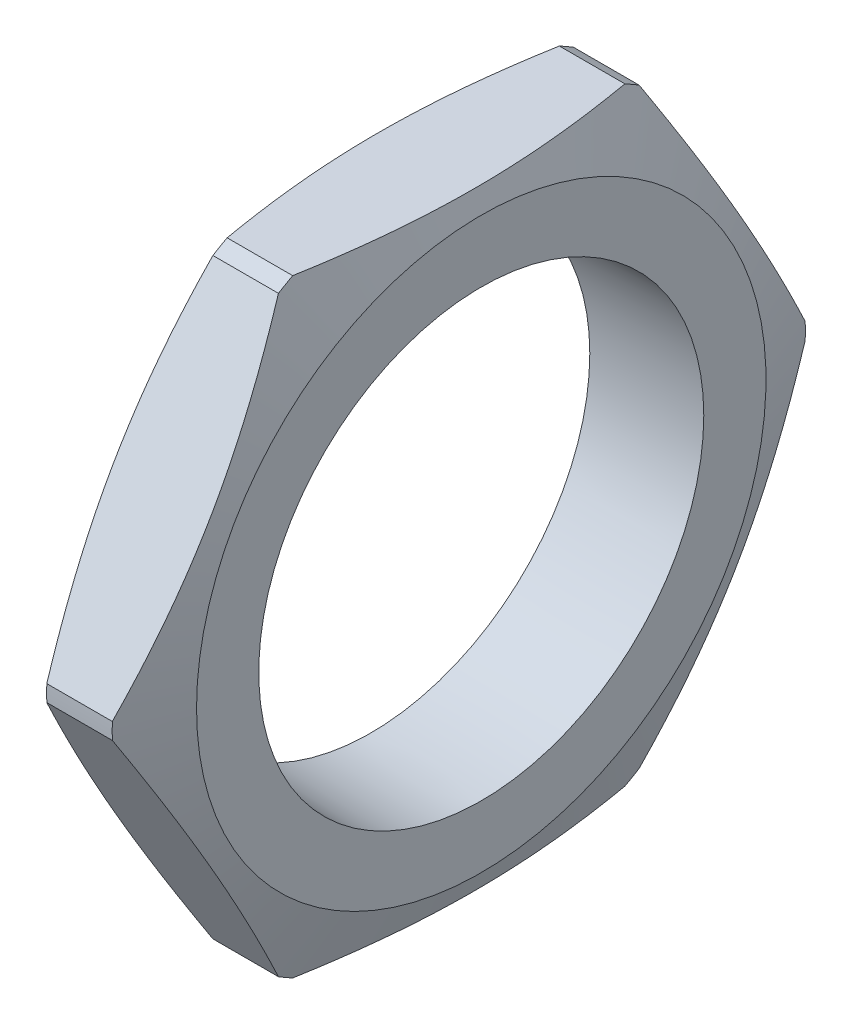
ISO-10303-21;
HEADER;
FILE_DESCRIPTION(('STEP AP214'),'2;1');
FILE_NAME('part.step','',(''),(''),'','','');
FILE_SCHEMA(('AUTOMOTIVE_DESIGN { 1 0 10303 214 1 1 1 1 }'));
ENDSEC;
DATA;
#1=APPLICATION_CONTEXT('core data for automotive mechanical design processes');
#2=APPLICATION_PROTOCOL_DEFINITION('international standard','automotive_design',2000,#1);
#3=PRODUCT_CONTEXT('',#1,'mechanical');
#4=PRODUCT('Part','Part','',(#3));
#5=PRODUCT_RELATED_PRODUCT_CATEGORY('part','',(#4));
#6=PRODUCT_DEFINITION_FORMATION('','',#4);
#7=PRODUCT_DEFINITION_CONTEXT('part definition',#1,'design');
#8=PRODUCT_DEFINITION('design','',#6,#7);
#9=PRODUCT_DEFINITION_SHAPE('','',#8);
#10=(LENGTH_UNIT() NAMED_UNIT(*) SI_UNIT(.MILLI.,.METRE.));
#11=(NAMED_UNIT(*) PLANE_ANGLE_UNIT() SI_UNIT($,.RADIAN.));
#12=(NAMED_UNIT(*) SI_UNIT($,.STERADIAN.) SOLID_ANGLE_UNIT());
#13=UNCERTAINTY_MEASURE_WITH_UNIT(LENGTH_MEASURE(1.E-05),#10,'distance_accuracy_value','');
#14=(GEOMETRIC_REPRESENTATION_CONTEXT(3) GLOBAL_UNCERTAINTY_ASSIGNED_CONTEXT((#13)) GLOBAL_UNIT_ASSIGNED_CONTEXT((#10,
#11,#12)) REPRESENTATION_CONTEXT('',''));
#15=CARTESIAN_POINT('',(0.,0.,0.));
#16=DIRECTION('',(0.,0.,1.));
#17=DIRECTION('',(1.,0.,0.));
#18=AXIS2_PLACEMENT_3D('',#15,#16,#17);
#19=CARTESIAN_POINT('',(3.365,0.,0.));
#20=DIRECTION('',(-1.,0.,0.));
#21=DIRECTION('',(0.,0.,1.));
#22=AXIS2_PLACEMENT_3D('',#19,#20,#21);
#23=CYLINDRICAL_SURFACE('',#22,9.97);
#24=DIRECTION('',(1.,0.,0.));
#25=VECTOR('',#24,1.);
#26=CARTESIAN_POINT('',(1.895,0.236304553364695,-9.96719921332266));
#27=LINE('',#26,#25);
#28=CARTESIAN_POINT('',(2.42213907652531,0.236304553364727,-9.96719921332264));
#29=VERTEX_POINT('',#28);
#30=CARTESIAN_POINT('',(4.30786092347469,0.236304553364728,-9.96719921332264));
#31=VERTEX_POINT('',#30);
#32=EDGE_CURVE('E101',#29,#31,#27,.T.);
#33=ORIENTED_EDGE('',*,*,#32,.T.);
#34=CARTESIAN_POINT('',(4.3078609234747,0.,0.));
#35=DIRECTION('',(-1.,0.,0.));
#36=DIRECTION('',(0.,-1.,0.));
#37=AXIS2_PLACEMENT_3D('',#34,#35,#36);
#38=CIRCLE('',#37,9.97);
#39=CARTESIAN_POINT('',(4.30786092347469,-0.236304553364675,-9.96719921332263));
#40=VERTEX_POINT('',#39);
#41=EDGE_CURVE('E119',#40,#31,#38,.F.);
#42=ORIENTED_EDGE('',*,*,#41,.F.);
#43=DIRECTION('',(1.,0.,0.));
#44=VECTOR('',#43,1.);
#45=CARTESIAN_POINT('',(1.895,-0.236304553364671,-9.96719921332263));
#46=LINE('',#45,#44);
#47=CARTESIAN_POINT('',(2.42213907652531,-0.236304553364674,-9.96719921332263));
#48=VERTEX_POINT('',#47);
#49=EDGE_CURVE('E290',#40,#48,#46,.F.);
#50=ORIENTED_EDGE('',*,*,#49,.T.);
#51=CARTESIAN_POINT('',(2.42213907652531,0.,0.));
#52=DIRECTION('',(-1.,0.,0.));
#53=DIRECTION('',(0.,0.,1.));
#54=AXIS2_PLACEMENT_3D('',#51,#52,#53);
#55=CIRCLE('',#54,9.97);
#56=EDGE_CURVE('E154',#48,#29,#55,.F.);
#57=ORIENTED_EDGE('',*,*,#56,.T.);
#58=EDGE_LOOP('',(#33,#42,#50,#57));
#59=FACE_BOUND('',#58,.T.);
#60=ADVANCED_FACE('F17',(#59),#23,.T.);
#61=CARTESIAN_POINT('',(3.365,0.,0.));
#62=DIRECTION('',(-1.,0.,0.));
#63=DIRECTION('',(0.,0.,1.));
#64=AXIS2_PLACEMENT_3D('',#61,#62,#63);
#65=CYLINDRICAL_SURFACE('',#64,9.97);
#66=DIRECTION('',(1.,0.,0.));
#67=VECTOR('',#66,1.);
#68=CARTESIAN_POINT('',(1.895,-8.51369544663533,-5.18824535290506));
#69=LINE('',#68,#67);
#70=CARTESIAN_POINT('',(2.42213907652531,-8.51369544663533,-5.18824535290506));
#71=VERTEX_POINT('',#70);
#72=CARTESIAN_POINT('',(4.30786092347469,-8.51369544663533,-5.18824535290506));
#73=VERTEX_POINT('',#72);
#74=EDGE_CURVE('E130',#71,#73,#69,.T.);
#75=ORIENTED_EDGE('',*,*,#74,.T.);
#76=CARTESIAN_POINT('',(4.30786092347469,0.,0.));
#77=DIRECTION('',(-1.,0.,0.));
#78=DIRECTION('',(0.,-1.,0.));
#79=AXIS2_PLACEMENT_3D('',#76,#77,#78);
#80=CIRCLE('',#79,9.97);
#81=CARTESIAN_POINT('',(4.30786092347469,-8.75,-4.77895386041757));
#82=VERTEX_POINT('',#81);
#83=EDGE_CURVE('E144',#82,#73,#80,.F.);
#84=ORIENTED_EDGE('',*,*,#83,.F.);
#85=DIRECTION('',(1.,0.,0.));
#86=VECTOR('',#85,1.);
#87=CARTESIAN_POINT('',(1.895,-8.75,-4.77895386041757));
#88=LINE('',#87,#86);
#89=CARTESIAN_POINT('',(2.42213907652531,-8.75,-4.77895386041757));
#90=VERTEX_POINT('',#89);
#91=EDGE_CURVE('E298',#82,#90,#88,.F.);
#92=ORIENTED_EDGE('',*,*,#91,.T.);
#93=CARTESIAN_POINT('',(2.42213907652531,0.,0.));
#94=DIRECTION('',(-1.,0.,0.));
#95=DIRECTION('',(0.,0.,1.));
#96=AXIS2_PLACEMENT_3D('',#93,#94,#95);
#97=CIRCLE('',#96,9.97);
#98=EDGE_CURVE('E151',#90,#71,#97,.F.);
#99=ORIENTED_EDGE('',*,*,#98,.T.);
#100=EDGE_LOOP('',(#75,#84,#92,#99));
#101=FACE_BOUND('',#100,.T.);
#102=ADVANCED_FACE('F292',(#101),#65,.T.);
#103=CARTESIAN_POINT('',(3.365,0.,0.));
#104=DIRECTION('',(-1.,0.,0.));
#105=DIRECTION('',(0.,0.,1.));
#106=AXIS2_PLACEMENT_3D('',#103,#104,#105);
#107=CYLINDRICAL_SURFACE('',#106,9.97);
#108=DIRECTION('',(1.,0.,0.));
#109=VECTOR('',#108,1.);
#110=CARTESIAN_POINT('',(1.895,-8.51369544663535,5.18824535290509));
#111=LINE('',#110,#109);
#112=CARTESIAN_POINT('',(4.30786092347469,-8.51369544663532,5.18824535290511));
#113=VERTEX_POINT('',#112);
#114=CARTESIAN_POINT('',(2.42213907652531,-8.51369544663532,5.18824535290511));
#115=VERTEX_POINT('',#114);
#116=EDGE_CURVE('E314',#113,#115,#111,.F.);
#117=ORIENTED_EDGE('',*,*,#116,.T.);
#118=CARTESIAN_POINT('',(2.42213907652531,0.,0.));
#119=DIRECTION('',(-1.,0.,0.));
#120=DIRECTION('',(0.,0.,1.));
#121=AXIS2_PLACEMENT_3D('',#118,#119,#120);
#122=CIRCLE('',#121,9.97);
#123=CARTESIAN_POINT('',(2.42213907652531,-8.75,4.77895386041757));
#124=VERTEX_POINT('',#123);
#125=EDGE_CURVE('E147',#115,#124,#122,.F.);
#126=ORIENTED_EDGE('',*,*,#125,.T.);
#127=DIRECTION('',(1.,0.,0.));
#128=VECTOR('',#127,1.);
#129=CARTESIAN_POINT('',(1.895,-8.75,4.77895386041757));
#130=LINE('',#129,#128);
#131=CARTESIAN_POINT('',(4.30786092347469,-8.75,4.77895386041757));
#132=VERTEX_POINT('',#131);
#133=EDGE_CURVE('E299',#124,#132,#130,.T.);
#134=ORIENTED_EDGE('',*,*,#133,.T.);
#135=CARTESIAN_POINT('',(4.30786092347469,0.,0.));
#136=DIRECTION('',(-1.,0.,0.));
#137=DIRECTION('',(0.,-1.,0.));
#138=AXIS2_PLACEMENT_3D('',#135,#136,#137);
#139=CIRCLE('',#138,9.97);
#140=EDGE_CURVE('E140',#113,#132,#139,.F.);
#141=ORIENTED_EDGE('',*,*,#140,.F.);
#142=EDGE_LOOP('',(#117,#126,#134,#141));
#143=FACE_BOUND('',#142,.T.);
#144=ADVANCED_FACE('F321',(#143),#107,.T.);
#145=CARTESIAN_POINT('',(3.365,0.,0.));
#146=DIRECTION('',(-1.,0.,0.));
#147=DIRECTION('',(0.,0.,1.));
#148=AXIS2_PLACEMENT_3D('',#145,#146,#147);
#149=CYLINDRICAL_SURFACE('',#148,9.97);
#150=DIRECTION('',(1.,0.,0.));
#151=VECTOR('',#150,1.);
#152=CARTESIAN_POINT('',(1.895,-0.236304553364695,9.96719921332266));
#153=LINE('',#152,#151);
#154=CARTESIAN_POINT('',(2.42213907652531,-0.236304553364727,9.96719921332264));
#155=VERTEX_POINT('',#154);
#156=CARTESIAN_POINT('',(4.30786092347469,-0.236304553364728,9.96719921332264));
#157=VERTEX_POINT('',#156);
#158=EDGE_CURVE('E300',#155,#157,#153,.T.);
#159=ORIENTED_EDGE('',*,*,#158,.T.);
#160=CARTESIAN_POINT('',(4.3078609234747,0.,0.));
#161=DIRECTION('',(-1.,0.,0.));
#162=DIRECTION('',(0.,-1.,0.));
#163=AXIS2_PLACEMENT_3D('',#160,#161,#162);
#164=CIRCLE('',#163,9.97);
#165=CARTESIAN_POINT('',(4.30786092347469,0.236304553364675,9.96719921332263));
#166=VERTEX_POINT('',#165);
#167=EDGE_CURVE('E118',#166,#157,#164,.F.);
#168=ORIENTED_EDGE('',*,*,#167,.F.);
#169=DIRECTION('',(1.,0.,0.));
#170=VECTOR('',#169,1.);
#171=CARTESIAN_POINT('',(1.895,0.236304553364671,9.96719921332263));
#172=LINE('',#171,#170);
#173=CARTESIAN_POINT('',(2.42213907652531,0.236304553364674,9.96719921332263));
#174=VERTEX_POINT('',#173);
#175=EDGE_CURVE('E257',#166,#174,#172,.F.);
#176=ORIENTED_EDGE('',*,*,#175,.T.);
#177=CARTESIAN_POINT('',(2.42213907652531,0.,0.));
#178=DIRECTION('',(-1.,0.,0.));
#179=DIRECTION('',(0.,0.,1.));
#180=AXIS2_PLACEMENT_3D('',#177,#178,#179);
#181=CIRCLE('',#180,9.97);
#182=EDGE_CURVE('E145',#174,#155,#181,.F.);
#183=ORIENTED_EDGE('',*,*,#182,.T.);
#184=EDGE_LOOP('',(#159,#168,#176,#183));
#185=FACE_BOUND('',#184,.T.);
#186=ADVANCED_FACE('F323',(#185),#149,.T.);
#187=CARTESIAN_POINT('',(3.365,0.,0.));
#188=DIRECTION('',(-1.,0.,0.));
#189=DIRECTION('',(0.,0.,1.));
#190=AXIS2_PLACEMENT_3D('',#187,#188,#189);
#191=CYLINDRICAL_SURFACE('',#190,9.97);
#192=DIRECTION('',(1.,0.,0.));
#193=VECTOR('',#192,1.);
#194=CARTESIAN_POINT('',(1.895,8.75,-4.77895386041757));
#195=LINE('',#194,#193);
#196=CARTESIAN_POINT('',(2.42213907652531,8.75,-4.77895386041757));
#197=VERTEX_POINT('',#196);
#198=CARTESIAN_POINT('',(4.30786092347469,8.75,-4.77895386041757));
#199=VERTEX_POINT('',#198);
#200=EDGE_CURVE('E116',#197,#199,#195,.T.);
#201=ORIENTED_EDGE('',*,*,#200,.T.);
#202=CARTESIAN_POINT('',(4.30786092347469,0.,0.));
#203=DIRECTION('',(-1.,0.,0.));
#204=DIRECTION('',(0.,-1.,0.));
#205=AXIS2_PLACEMENT_3D('',#202,#203,#204);
#206=CIRCLE('',#205,9.97);
#207=CARTESIAN_POINT('',(4.30786092347469,8.51369544663532,-5.18824535290511));
#208=VERTEX_POINT('',#207);
#209=EDGE_CURVE('E108',#208,#199,#206,.F.);
#210=ORIENTED_EDGE('',*,*,#209,.F.);
#211=DIRECTION('',(1.,0.,0.));
#212=VECTOR('',#211,1.);
#213=CARTESIAN_POINT('',(1.895,8.51369544663535,-5.18824535290509));
#214=LINE('',#213,#212);
#215=CARTESIAN_POINT('',(2.42213907652532,8.51369544663532,-5.18824535290511));
#216=VERTEX_POINT('',#215);
#217=EDGE_CURVE('E113',#208,#216,#214,.F.);
#218=ORIENTED_EDGE('',*,*,#217,.T.);
#219=CARTESIAN_POINT('',(2.42213907652531,0.,0.));
#220=DIRECTION('',(-1.,0.,0.));
#221=DIRECTION('',(0.,0.,1.));
#222=AXIS2_PLACEMENT_3D('',#219,#220,#221);
#223=CIRCLE('',#222,9.97);
#224=EDGE_CURVE('E142',#216,#197,#223,.F.);
#225=ORIENTED_EDGE('',*,*,#224,.T.);
#226=EDGE_LOOP('',(#201,#210,#218,#225));
#227=FACE_BOUND('',#226,.T.);
#228=ADVANCED_FACE('F110',(#227),#191,.T.);
#229=CARTESIAN_POINT('',(4.30786092347469,0.,0.));
#230=DIRECTION('',(-1.,0.,0.));
#231=DIRECTION('',(0.,0.,1.));
#232=AXIS2_PLACEMENT_3D('',#229,#230,#231);
#233=CONICAL_SURFACE('',#232,9.97,1.22173047639603);
#234=CARTESIAN_POINT('',(4.955,0.,0.));
#235=DIRECTION('',(-1.,0.,0.));
#236=DIRECTION('',(0.,0.,1.));
#237=AXIS2_PLACEMENT_3D('',#234,#235,#236);
#238=CIRCLE('',#237,8.192);
#239=CARTESIAN_POINT('',(4.955,0.,8.192));
#240=VERTEX_POINT('',#239);
#241=EDGE_CURVE('E20',#240,#240,#238,.F.);
#242=ORIENTED_EDGE('',*,*,#241,.F.);
#243=EDGE_LOOP('',(#242));
#244=FACE_BOUND('',#243,.T.);
#245=ORIENTED_EDGE('',*,*,#140,.T.);
#246=CARTESIAN_POINT('',(4.30786092347469,-8.75,4.77895386041757));
#247=CARTESIAN_POINT('',(4.37697795547099,-8.75,4.38297144304946));
#248=CARTESIAN_POINT('',(4.43964204819473,-8.75,3.98575976444245));
#249=CARTESIAN_POINT('',(4.54963442625098,-8.75,3.18897384576645));
#250=CARTESIAN_POINT('',(4.59695282204229,-8.75,2.78939825047187));
#251=CARTESIAN_POINT('',(4.67339904428993,-8.75,1.99192876156903));
#252=CARTESIAN_POINT('',(4.70267955489557,-8.75,1.594049881826));
#253=CARTESIAN_POINT('',(4.74192936039943,-8.75,0.797447135719653));
#254=CARTESIAN_POINT('',(4.75190460927946,-8.75,0.398723567859826));
#255=CARTESIAN_POINT('',(4.75190460927946,-8.75,-0.398723567859829));
#256=CARTESIAN_POINT('',(4.74192936039943,-8.75,-0.797447135719656));
#257=CARTESIAN_POINT('',(4.70267955489557,-8.75,-1.594049881826));
#258=CARTESIAN_POINT('',(4.67339904428993,-8.75,-1.99192876156903));
#259=CARTESIAN_POINT('',(4.59695282204229,-8.75,-2.78939825047187));
#260=CARTESIAN_POINT('',(4.54963442625098,-8.75,-3.18897384576645));
#261=CARTESIAN_POINT('',(4.43964204819473,-8.75,-3.98575976444245));
#262=CARTESIAN_POINT('',(4.37697795547099,-8.75,-4.38297144304947));
#263=CARTESIAN_POINT('',(4.30786092347469,-8.75,-4.77895386041757));
#264=B_SPLINE_CURVE_WITH_KNOTS('',3,(#246,#247,#248,#249,#250,#251,#252,#253,#254,#255,#256,
#257,#258,#259,#260,#261,#262,#263),.UNSPECIFIED.,.F.,.F.,(4,2,2,2,2,2,2,2,4),(0.,
1.20600732058064,2.41279031576098,3.60921269125418,4.80526601642896,6.00131934160374,
7.19774171709695,8.40452471227728,9.61053203285793),.UNSPECIFIED.);
#265=EDGE_CURVE('E242',#132,#82,#264,.T.);
#266=ORIENTED_EDGE('',*,*,#265,.T.);
#267=ORIENTED_EDGE('',*,*,#83,.T.);
#268=CARTESIAN_POINT('',(4.30786092347469,-8.51369544663533,-5.18824535290506));
#269=CARTESIAN_POINT('',(4.37697795547099,-8.17076461374258,-5.38623656158911));
#270=CARTESIAN_POINT('',(4.43964204819473,-7.82676920938905,-5.58484240089262));
#271=CARTESIAN_POINT('',(4.54963442625098,-7.1367323624379,-5.98323536023062));
#272=CARTESIAN_POINT('',(4.59695282204229,-6.79068974618051,-6.18302315787791));
#273=CARTESIAN_POINT('',(4.67339904428993,-6.10006091004766,-6.58175790232933));
#274=CARTESIAN_POINT('',(4.70267955489557,-5.7554876925609,-6.78069734220084));
#275=CARTESIAN_POINT('',(4.74192936039942,-5.06560947770836,-7.17899871525401));
#276=CARTESIAN_POINT('',(4.75190460927946,-4.72030473885418,-7.37836049918393));
#277=CARTESIAN_POINT('',(4.75190460927946,-4.02969526114582,-7.77708406704375));
#278=CARTESIAN_POINT('',(4.74192936039942,-3.68439052229164,-7.97644585097367));
#279=CARTESIAN_POINT('',(4.70267955489557,-2.9945123074391,-8.37474722402684));
#280=CARTESIAN_POINT('',(4.67339904428993,-2.64993908995234,-8.57368666389836));
#281=CARTESIAN_POINT('',(4.59695282204229,-1.95931025381949,-8.97242140834978));
#282=CARTESIAN_POINT('',(4.54963442625098,-1.6132676375621,-9.17220920599707));
#283=CARTESIAN_POINT('',(4.43964204819473,-0.923230790610953,-9.57060216533507));
#284=CARTESIAN_POINT('',(4.37697795547099,-0.579235386257421,-9.76920800463858));
#285=CARTESIAN_POINT('',(4.30786092347469,-0.236304553364669,-9.96719921332263));
#286=B_SPLINE_CURVE_WITH_KNOTS('',3,(#268,#269,#270,#271,#272,#273,#274,#275,#276,#277,#278,
#279,#280,#281,#282,#283,#284,#285),.UNSPECIFIED.,.F.,.F.,(4,2,2,2,2,2,2,2,4),(0.,
1.20600732058064,2.41279031576098,3.60921269125418,4.80526601642896,6.00131934160375,
7.19774171709695,8.40452471227729,9.61053203285793),.UNSPECIFIED.);
#287=EDGE_CURVE('E132',#73,#40,#286,.T.);
#288=ORIENTED_EDGE('',*,*,#287,.T.);
#289=ORIENTED_EDGE('',*,*,#41,.T.);
#290=CARTESIAN_POINT('',(4.30786092347468,0.236304553364696,-9.96719921332266));
#291=CARTESIAN_POINT('',(4.37697795547098,0.579235386257448,-9.7692080046386));
#292=CARTESIAN_POINT('',(4.43964204819472,0.923230790610979,-9.5706021653351));
#293=CARTESIAN_POINT('',(4.54963442625096,1.61326763756212,-9.1722092059971));
#294=CARTESIAN_POINT('',(4.59695282204228,1.95931025381952,-8.97242140834981));
#295=CARTESIAN_POINT('',(4.67339904428991,2.64993908995237,-8.57368666389839));
#296=CARTESIAN_POINT('',(4.70267955489555,2.99451230743912,-8.37474722402688));
#297=CARTESIAN_POINT('',(4.74192936039941,3.68439052229167,-7.9764458509737));
#298=CARTESIAN_POINT('',(4.75190460927945,4.02969526114584,-7.77708406704379));
#299=CARTESIAN_POINT('',(4.75190460927945,4.7203047388542,-7.37836049918396));
#300=CARTESIAN_POINT('',(4.74192936039941,5.06560947770838,-7.17899871525405));
#301=CARTESIAN_POINT('',(4.70267955489555,5.75548769256092,-6.78069734220087));
#302=CARTESIAN_POINT('',(4.67339904428991,6.10006091004768,-6.58175790232936));
#303=CARTESIAN_POINT('',(4.59695282204228,6.79068974618053,-6.18302315787794));
#304=CARTESIAN_POINT('',(4.54963442625096,7.13673236243793,-5.98323536023065));
#305=CARTESIAN_POINT('',(4.43964204819472,7.82676920938907,-5.58484240089265));
#306=CARTESIAN_POINT('',(4.37697795547097,8.1707646137426,-5.38623656158914));
#307=CARTESIAN_POINT('',(4.30786092347468,8.51369544663535,-5.18824535290509));
#308=B_SPLINE_CURVE_WITH_KNOTS('',3,(#290,#291,#292,#293,#294,#295,#296,#297,#298,#299,#300,
#301,#302,#303,#304,#305,#306,#307),.UNSPECIFIED.,.F.,.F.,(4,2,2,2,2,2,2,2,4),(0.,
1.20600732058064,2.41279031576098,3.60921269125418,4.80526601642896,6.00131934160374,
7.19774171709695,8.40452471227728,9.61053203285792),.UNSPECIFIED.);
#309=EDGE_CURVE('E122',#31,#208,#308,.T.);
#310=ORIENTED_EDGE('',*,*,#309,.T.);
#311=ORIENTED_EDGE('',*,*,#209,.T.);
#312=CARTESIAN_POINT('',(4.30786092347469,8.75,-4.77895386041757));
#313=CARTESIAN_POINT('',(4.37697795547099,8.75,-4.38297144304946));
#314=CARTESIAN_POINT('',(4.43964204819473,8.75,-3.98575976444245));
#315=CARTESIAN_POINT('',(4.54963442625098,8.75,-3.18897384576645));
#316=CARTESIAN_POINT('',(4.59695282204229,8.75,-2.78939825047187));
#317=CARTESIAN_POINT('',(4.67339904428993,8.75,-1.99192876156903));
#318=CARTESIAN_POINT('',(4.70267955489557,8.75,-1.594049881826));
#319=CARTESIAN_POINT('',(4.74192936039943,8.75,-0.797447135719654));
#320=CARTESIAN_POINT('',(4.75190460927946,8.75,-0.398723567859826));
#321=CARTESIAN_POINT('',(4.75190460927946,8.75,0.398723567859829));
#322=CARTESIAN_POINT('',(4.74192936039943,8.75,0.797447135719656));
#323=CARTESIAN_POINT('',(4.70267955489557,8.75,1.594049881826));
#324=CARTESIAN_POINT('',(4.67339904428993,8.75,1.99192876156903));
#325=CARTESIAN_POINT('',(4.59695282204229,8.75,2.78939825047187));
#326=CARTESIAN_POINT('',(4.54963442625098,8.75,3.18897384576645));
#327=CARTESIAN_POINT('',(4.43964204819473,8.75,3.98575976444245));
#328=CARTESIAN_POINT('',(4.37697795547099,8.75,4.38297144304947));
#329=CARTESIAN_POINT('',(4.30786092347469,8.75,4.77895386041757));
#330=B_SPLINE_CURVE_WITH_KNOTS('',3,(#312,#313,#314,#315,#316,#317,#318,#319,#320,#321,#322,
#323,#324,#325,#326,#327,#328,#329),.UNSPECIFIED.,.F.,.F.,(4,2,2,2,2,2,2,2,4),(0.,
1.20600732058064,2.41279031576098,3.60921269125418,4.80526601642896,6.00131934160374,
7.19774171709695,8.40452471227728,9.61053203285793),.UNSPECIFIED.);
#331=CARTESIAN_POINT('',(4.30786092347469,8.75,4.77895386041757));
#332=VERTEX_POINT('',#331);
#333=EDGE_CURVE('E247',#199,#332,#330,.T.);
#334=ORIENTED_EDGE('',*,*,#333,.T.);
#335=CARTESIAN_POINT('',(4.30786092347469,0.,0.));
#336=DIRECTION('',(-1.,0.,0.));
#337=DIRECTION('',(0.,0.,1.));
#338=AXIS2_PLACEMENT_3D('',#335,#336,#337);
#339=CIRCLE('',#338,9.97);
#340=CARTESIAN_POINT('',(4.30786092347469,8.51369544663533,5.18824535290506));
#341=VERTEX_POINT('',#340);
#342=EDGE_CURVE('E137',#341,#332,#339,.T.);
#343=ORIENTED_EDGE('',*,*,#342,.F.);
#344=CARTESIAN_POINT('',(4.30786092347469,8.51369544663533,5.18824535290506));
#345=CARTESIAN_POINT('',(4.37697795547099,8.17076461374258,5.38623656158911));
#346=CARTESIAN_POINT('',(4.43964204819473,7.82676920938905,5.58484240089261));
#347=CARTESIAN_POINT('',(4.54963442625098,7.1367323624379,5.98323536023062));
#348=CARTESIAN_POINT('',(4.59695282204229,6.79068974618051,6.18302315787791));
#349=CARTESIAN_POINT('',(4.67339904428993,6.10006091004766,6.58175790232932));
#350=CARTESIAN_POINT('',(4.70267955489557,5.7554876925609,6.78069734220084));
#351=CARTESIAN_POINT('',(4.74192936039943,5.06560947770836,7.17899871525401));
#352=CARTESIAN_POINT('',(4.75190460927946,4.72030473885418,7.37836049918393));
#353=CARTESIAN_POINT('',(4.75190460927946,4.02969526114582,7.77708406704376));
#354=CARTESIAN_POINT('',(4.74192936039942,3.68439052229164,7.97644585097367));
#355=CARTESIAN_POINT('',(4.70267955489557,2.9945123074391,8.37474722402684));
#356=CARTESIAN_POINT('',(4.67339904428993,2.64993908995234,8.57368666389836));
#357=CARTESIAN_POINT('',(4.59695282204229,1.95931025381949,8.97242140834978));
#358=CARTESIAN_POINT('',(4.54963442625098,1.6132676375621,9.17220920599707));
#359=CARTESIAN_POINT('',(4.43964204819473,0.923230790610954,9.57060216533507));
#360=CARTESIAN_POINT('',(4.37697795547099,0.579235386257422,9.76920800463857));
#361=CARTESIAN_POINT('',(4.30786092347469,0.23630455336467,9.96719921332263));
#362=B_SPLINE_CURVE_WITH_KNOTS('',3,(#344,#345,#346,#347,#348,#349,#350,#351,#352,#353,#354,
#355,#356,#357,#358,#359,#360,#361),.UNSPECIFIED.,.F.,.F.,(4,2,2,2,2,2,2,2,4),(0.,
1.20600732058064,2.41279031576098,3.60921269125418,4.80526601642897,6.00131934160375,
7.19774171709695,8.40452471227729,9.61053203285793),.UNSPECIFIED.);
#363=EDGE_CURVE('E252',#341,#166,#362,.T.);
#364=ORIENTED_EDGE('',*,*,#363,.T.);
#365=ORIENTED_EDGE('',*,*,#167,.T.);
#366=CARTESIAN_POINT('',(4.30786092347468,-0.236304553364697,9.96719921332266));
#367=CARTESIAN_POINT('',(4.37697795547098,-0.579235386257448,9.76920800463861));
#368=CARTESIAN_POINT('',(4.43964204819472,-0.92323079061098,9.5706021653351));
#369=CARTESIAN_POINT('',(4.54963442625096,-1.61326763756212,9.1722092059971));
#370=CARTESIAN_POINT('',(4.59695282204228,-1.95931025381952,8.97242140834981));
#371=CARTESIAN_POINT('',(4.67339904428991,-2.64993908995237,8.57368666389839));
#372=CARTESIAN_POINT('',(4.70267955489555,-2.99451230743912,8.37474722402687));
#373=CARTESIAN_POINT('',(4.74192936039941,-3.68439052229167,7.9764458509737));
#374=CARTESIAN_POINT('',(4.75190460927945,-4.02969526114585,7.77708406704379));
#375=CARTESIAN_POINT('',(4.75190460927945,-4.7203047388542,7.37836049918396));
#376=CARTESIAN_POINT('',(4.74192936039941,-5.06560947770838,7.17899871525405));
#377=CARTESIAN_POINT('',(4.70267955489555,-5.75548769256092,6.78069734220087));
#378=CARTESIAN_POINT('',(4.67339904428991,-6.10006091004768,6.58175790232936));
#379=CARTESIAN_POINT('',(4.59695282204228,-6.79068974618053,6.18302315787794));
#380=CARTESIAN_POINT('',(4.54963442625096,-7.13673236243792,5.98323536023065));
#381=CARTESIAN_POINT('',(4.43964204819472,-7.82676920938907,5.58484240089265));
#382=CARTESIAN_POINT('',(4.37697795547097,-8.1707646137426,5.38623656158914));
#383=CARTESIAN_POINT('',(4.30786092347468,-8.51369544663535,5.18824535290509));
#384=B_SPLINE_CURVE_WITH_KNOTS('',3,(#366,#367,#368,#369,#370,#371,#372,#373,#374,#375,#376,
#377,#378,#379,#380,#381,#382,#383),.UNSPECIFIED.,.F.,.F.,(4,2,2,2,2,2,2,2,4),(0.,
1.20600732058064,2.41279031576098,3.60921269125418,4.80526601642896,6.00131934160374,
7.19774171709695,8.40452471227728,9.61053203285792),.UNSPECIFIED.);
#385=EDGE_CURVE('E235',#157,#113,#384,.T.);
#386=ORIENTED_EDGE('',*,*,#385,.T.);
#387=EDGE_LOOP('',(#245,#266,#267,#288,#289,#310,#311,#334,#343,#364,#365,#386));
#388=FACE_BOUND('',#387,.T.);
#389=ADVANCED_FACE('F124',(#244,#388),#233,.T.);
#390=CARTESIAN_POINT('',(3.365,0.,0.));
#391=DIRECTION('',(-1.,0.,0.));
#392=DIRECTION('',(0.,0.,1.));
#393=AXIS2_PLACEMENT_3D('',#390,#391,#392);
#394=CYLINDRICAL_SURFACE('',#393,9.97);
#395=DIRECTION('',(1.,0.,0.));
#396=VECTOR('',#395,1.);
#397=CARTESIAN_POINT('',(1.895,8.51369544663533,5.18824535290506));
#398=LINE('',#397,#396);
#399=CARTESIAN_POINT('',(2.42213907652531,8.51369544663533,5.18824535290506));
#400=VERTEX_POINT('',#399);
#401=EDGE_CURVE('E258',#400,#341,#398,.T.);
#402=ORIENTED_EDGE('',*,*,#401,.T.);
#403=ORIENTED_EDGE('',*,*,#342,.T.);
#404=DIRECTION('',(1.,0.,0.));
#405=VECTOR('',#404,1.);
#406=CARTESIAN_POINT('',(1.895,8.75,4.77895386041757));
#407=LINE('',#406,#405);
#408=CARTESIAN_POINT('',(2.42213907652531,8.75,4.77895386041757));
#409=VERTEX_POINT('',#408);
#410=EDGE_CURVE('E251',#332,#409,#407,.F.);
#411=ORIENTED_EDGE('',*,*,#410,.T.);
#412=CARTESIAN_POINT('',(2.42213907652531,0.,0.));
#413=DIRECTION('',(-1.,0.,0.));
#414=DIRECTION('',(0.,0.,1.));
#415=AXIS2_PLACEMENT_3D('',#412,#413,#414);
#416=CIRCLE('',#415,9.97);
#417=EDGE_CURVE('E35',#409,#400,#416,.F.);
#418=ORIENTED_EDGE('',*,*,#417,.T.);
#419=EDGE_LOOP('',(#402,#403,#411,#418));
#420=FACE_BOUND('',#419,.T.);
#421=ADVANCED_FACE('F229',(#420),#394,.T.);
#422=CARTESIAN_POINT('',(4.955,-4.096,0.));
#423=DIRECTION('',(1.,0.,0.));
#424=DIRECTION('',(0.,0.,-1.));
#425=AXIS2_PLACEMENT_3D('',#422,#423,#424);
#426=PLANE('',#425);
#427=ORIENTED_EDGE('',*,*,#241,.T.);
#428=EDGE_LOOP('',(#427));
#429=FACE_BOUND('',#428,.T.);
#430=CARTESIAN_POINT('',(4.95499999999538,0.,0.));
#431=DIRECTION('',(1.,0.,0.));
#432=DIRECTION('',(0.,0.,-1.));
#433=AXIS2_PLACEMENT_3D('',#430,#431,#432);
#434=CIRCLE('',#433,6.40202274590784);
#435=CARTESIAN_POINT('',(4.95499999999538,0.,-6.40202274590784));
#436=VERTEX_POINT('',#435);
#437=EDGE_CURVE('E206',#436,#436,#434,.F.);
#438=ORIENTED_EDGE('',*,*,#437,.T.);
#439=EDGE_LOOP('',(#438));
#440=FACE_BOUND('',#439,.T.);
#441=ADVANCED_FACE('F212',(#429,#440),#426,.T.);
#442=CARTESIAN_POINT('',(1.895,0.,-10.1036297108185));
#443=DIRECTION('',(0.,-0.5,0.866025403784439));
#444=DIRECTION('',(0.,-0.866025403784439,-0.5));
#445=AXIS2_PLACEMENT_3D('',#442,#443,#444);
#446=PLANE('',#445);
#447=ORIENTED_EDGE('',*,*,#217,.F.);
#448=ORIENTED_EDGE('',*,*,#309,.F.);
#449=ORIENTED_EDGE('',*,*,#32,.F.);
#450=CARTESIAN_POINT('',(2.42213907652532,8.51369544663535,-5.18824535290509));
#451=CARTESIAN_POINT('',(2.35302204452902,8.1707646137426,-5.38623656158914));
#452=CARTESIAN_POINT('',(2.29035795180528,7.82676920938907,-5.58484240089265));
#453=CARTESIAN_POINT('',(2.18036557374904,7.13673236243792,-5.98323536023065));
#454=CARTESIAN_POINT('',(2.13304717795772,6.79068974618053,-6.18302315787794));
#455=CARTESIAN_POINT('',(2.05660095571009,6.10006091004768,-6.58175790232936));
#456=CARTESIAN_POINT('',(2.02732044510445,5.75548769256092,-6.78069734220087));
#457=CARTESIAN_POINT('',(1.98807063960059,5.06560947770838,-7.17899871525405));
#458=CARTESIAN_POINT('',(1.97809539072055,4.7203047388542,-7.37836049918396));
#459=CARTESIAN_POINT('',(1.97809539072055,4.02969526114585,-7.77708406704379));
#460=CARTESIAN_POINT('',(1.98807063960059,3.68439052229167,-7.9764458509737));
#461=CARTESIAN_POINT('',(2.02732044510445,2.99451230743912,-8.37474722402687));
#462=CARTESIAN_POINT('',(2.05660095571009,2.64993908995237,-8.57368666389839));
#463=CARTESIAN_POINT('',(2.13304717795772,1.95931025381952,-8.97242140834981));
#464=CARTESIAN_POINT('',(2.18036557374904,1.61326763756212,-9.1722092059971));
#465=CARTESIAN_POINT('',(2.29035795180528,0.923230790610979,-9.5706021653351));
#466=CARTESIAN_POINT('',(2.35302204452902,0.579235386257448,-9.76920800463861));
#467=CARTESIAN_POINT('',(2.42213907652532,0.236304553364696,-9.96719921332266));
#468=B_SPLINE_CURVE_WITH_KNOTS('',3,(#450,#451,#452,#453,#454,#455,#456,#457,#458,#459,#460,
#461,#462,#463,#464,#465,#466,#467),.UNSPECIFIED.,.F.,.F.,(4,2,2,2,2,2,2,2,4),(0.,
1.20600732058064,2.41279031576098,3.60921269125418,4.80526601642896,6.00131934160374,
7.19774171709695,8.40452471227729,9.61053203285793),.UNSPECIFIED.);
#469=EDGE_CURVE('E129',#216,#29,#468,.T.);
#470=ORIENTED_EDGE('',*,*,#469,.F.);
#471=EDGE_LOOP('',(#447,#448,#449,#470));
#472=FACE_BOUND('',#471,.T.);
#473=ADVANCED_FACE('F127',(#472),#446,.F.);
#474=CARTESIAN_POINT('',(1.895,-8.75,-5.05181485540923));
#475=DIRECTION('',(0.,0.5,0.866025403784439));
#476=DIRECTION('',(0.,-0.866025403784439,0.5));
#477=AXIS2_PLACEMENT_3D('',#474,#475,#476);
#478=PLANE('',#477);
#479=ORIENTED_EDGE('',*,*,#49,.F.);
#480=ORIENTED_EDGE('',*,*,#287,.F.);
#481=ORIENTED_EDGE('',*,*,#74,.F.);
#482=CARTESIAN_POINT('',(2.42213907652531,-0.236304553364671,-9.96719921332263));
#483=CARTESIAN_POINT('',(2.35302204452901,-0.579235386257423,-9.76920800463857));
#484=CARTESIAN_POINT('',(2.29035795180527,-0.923230790610955,-9.57060216533507));
#485=CARTESIAN_POINT('',(2.18036557374902,-1.6132676375621,-9.17220920599706));
#486=CARTESIAN_POINT('',(2.13304717795771,-1.95931025381949,-8.97242140834978));
#487=CARTESIAN_POINT('',(2.05660095571007,-2.64993908995234,-8.57368666389836));
#488=CARTESIAN_POINT('',(2.02732044510443,-2.9945123074391,-8.37474722402684));
#489=CARTESIAN_POINT('',(1.98807063960057,-3.68439052229164,-7.97644585097367));
#490=CARTESIAN_POINT('',(1.97809539072054,-4.02969526114582,-7.77708406704375));
#491=CARTESIAN_POINT('',(1.97809539072054,-4.72030473885418,-7.37836049918393));
#492=CARTESIAN_POINT('',(1.98807063960057,-5.06560947770836,-7.17899871525401));
#493=CARTESIAN_POINT('',(2.02732044510443,-5.7554876925609,-6.78069734220084));
#494=CARTESIAN_POINT('',(2.05660095571007,-6.10006091004766,-6.58175790232932));
#495=CARTESIAN_POINT('',(2.13304717795771,-6.79068974618051,-6.18302315787791));
#496=CARTESIAN_POINT('',(2.18036557374902,-7.1367323624379,-5.98323536023062));
#497=CARTESIAN_POINT('',(2.29035795180527,-7.82676920938905,-5.58484240089262));
#498=CARTESIAN_POINT('',(2.35302204452901,-8.17076461374258,-5.38623656158911));
#499=CARTESIAN_POINT('',(2.42213907652531,-8.51369544663533,-5.18824535290506));
#500=B_SPLINE_CURVE_WITH_KNOTS('',3,(#482,#483,#484,#485,#486,#487,#488,#489,#490,#491,#492,
#493,#494,#495,#496,#497,#498,#499),.UNSPECIFIED.,.F.,.F.,(4,2,2,2,2,2,2,2,4),(0.,
1.20600732058064,2.41279031576098,3.60921269125418,4.80526601642896,6.00131934160375,
7.19774171709695,8.40452471227729,9.61053203285793),.UNSPECIFIED.);
#501=EDGE_CURVE('E194',#48,#71,#500,.T.);
#502=ORIENTED_EDGE('',*,*,#501,.F.);
#503=EDGE_LOOP('',(#479,#480,#481,#502));
#504=FACE_BOUND('',#503,.T.);
#505=ADVANCED_FACE('F211',(#504),#478,.F.);
#506=CARTESIAN_POINT('',(1.895,-8.75,5.05181485540922));
#507=DIRECTION('',(0.,1.,0.));
#508=DIRECTION('',(0.,0.,1.));
#509=AXIS2_PLACEMENT_3D('',#506,#507,#508);
#510=PLANE('',#509);
#511=ORIENTED_EDGE('',*,*,#91,.F.);
#512=ORIENTED_EDGE('',*,*,#265,.F.);
#513=ORIENTED_EDGE('',*,*,#133,.F.);
#514=CARTESIAN_POINT('',(2.4221390765253,-8.75,-4.77895386041757));
#515=CARTESIAN_POINT('',(2.35302204452901,-8.75,-4.38297144304947));
#516=CARTESIAN_POINT('',(2.29035795180527,-8.75,-3.98575976444245));
#517=CARTESIAN_POINT('',(2.18036557374902,-8.75,-3.18897384576645));
#518=CARTESIAN_POINT('',(2.13304717795771,-8.75,-2.78939825047187));
#519=CARTESIAN_POINT('',(2.05660095571007,-8.75,-1.99192876156903));
#520=CARTESIAN_POINT('',(2.02732044510443,-8.75,-1.594049881826));
#521=CARTESIAN_POINT('',(1.98807063960057,-8.75,-0.797447135719655));
#522=CARTESIAN_POINT('',(1.97809539072054,-8.75,-0.398723567859828));
#523=CARTESIAN_POINT('',(1.97809539072054,-8.75,0.398723567859828));
#524=CARTESIAN_POINT('',(1.98807063960057,-8.75,0.797447135719656));
#525=CARTESIAN_POINT('',(2.02732044510443,-8.75,1.594049881826));
#526=CARTESIAN_POINT('',(2.05660095571007,-8.75,1.99192876156903));
#527=CARTESIAN_POINT('',(2.13304717795771,-8.75,2.78939825047187));
#528=CARTESIAN_POINT('',(2.18036557374902,-8.75,3.18897384576645));
#529=CARTESIAN_POINT('',(2.29035795180527,-8.75,3.98575976444245));
#530=CARTESIAN_POINT('',(2.35302204452901,-8.75,4.38297144304947));
#531=CARTESIAN_POINT('',(2.4221390765253,-8.75,4.77895386041757));
#532=B_SPLINE_CURVE_WITH_KNOTS('',3,(#514,#515,#516,#517,#518,#519,#520,#521,#522,#523,#524,
#525,#526,#527,#528,#529,#530,#531),.UNSPECIFIED.,.F.,.F.,(4,2,2,2,2,2,2,2,4),(0.,
1.20600732058064,2.41279031576098,3.60921269125418,4.80526601642896,6.00131934160374,
7.19774171709695,8.40452471227729,9.61053203285793),.UNSPECIFIED.);
#533=EDGE_CURVE('E274',#90,#124,#532,.T.);
#534=ORIENTED_EDGE('',*,*,#533,.F.);
#535=EDGE_LOOP('',(#511,#512,#513,#534));
#536=FACE_BOUND('',#535,.T.);
#537=ADVANCED_FACE('F267',(#536),#510,.F.);
#538=CARTESIAN_POINT('',(1.895,0.,10.1036297108185));
#539=DIRECTION('',(0.,0.5,-0.866025403784439));
#540=DIRECTION('',(0.,0.866025403784439,0.5));
#541=AXIS2_PLACEMENT_3D('',#538,#539,#540);
#542=PLANE('',#541);
#543=ORIENTED_EDGE('',*,*,#116,.F.);
#544=ORIENTED_EDGE('',*,*,#385,.F.);
#545=ORIENTED_EDGE('',*,*,#158,.F.);
#546=CARTESIAN_POINT('',(2.42213907652532,-8.51369544663535,5.18824535290509));
#547=CARTESIAN_POINT('',(2.35302204452903,-8.1707646137426,5.38623656158915));
#548=CARTESIAN_POINT('',(2.29035795180528,-7.82676920938907,5.58484240089265));
#549=CARTESIAN_POINT('',(2.18036557374904,-7.13673236243792,5.98323536023065));
#550=CARTESIAN_POINT('',(2.13304717795772,-6.79068974618053,6.18302315787794));
#551=CARTESIAN_POINT('',(2.05660095571009,-6.10006091004768,6.58175790232936));
#552=CARTESIAN_POINT('',(2.02732044510444,-5.75548769256092,6.78069734220087));
#553=CARTESIAN_POINT('',(1.98807063960059,-5.06560947770838,7.17899871525405));
#554=CARTESIAN_POINT('',(1.97809539072055,-4.7203047388542,7.37836049918396));
#555=CARTESIAN_POINT('',(1.97809539072055,-4.02969526114584,7.77708406704379));
#556=CARTESIAN_POINT('',(1.98807063960059,-3.68439052229166,7.9764458509737));
#557=CARTESIAN_POINT('',(2.02732044510444,-2.99451230743912,8.37474722402687));
#558=CARTESIAN_POINT('',(2.05660095571009,-2.64993908995237,8.57368666389839));
#559=CARTESIAN_POINT('',(2.13304717795772,-1.95931025381952,8.97242140834981));
#560=CARTESIAN_POINT('',(2.18036557374904,-1.61326763756212,9.1722092059971));
#561=CARTESIAN_POINT('',(2.29035795180528,-0.923230790610978,9.5706021653351));
#562=CARTESIAN_POINT('',(2.35302204452902,-0.579235386257447,9.7692080046386));
#563=CARTESIAN_POINT('',(2.42213907652532,-0.236304553364695,9.96719921332266));
#564=B_SPLINE_CURVE_WITH_KNOTS('',3,(#546,#547,#548,#549,#550,#551,#552,#553,#554,#555,#556,
#557,#558,#559,#560,#561,#562,#563),.UNSPECIFIED.,.F.,.F.,(4,2,2,2,2,2,2,2,4),(0.,
1.20600732058064,2.41279031576098,3.60921269125418,4.80526601642896,6.00131934160374,
7.19774171709694,8.40452471227728,9.61053203285792),.UNSPECIFIED.);
#565=EDGE_CURVE('E185',#115,#155,#564,.T.);
#566=ORIENTED_EDGE('',*,*,#565,.F.);
#567=EDGE_LOOP('',(#543,#544,#545,#566));
#568=FACE_BOUND('',#567,.T.);
#569=ADVANCED_FACE('F262',(#568),#542,.F.);
#570=CARTESIAN_POINT('',(1.895,8.75,5.05181485540923));
#571=DIRECTION('',(0.,-0.5,-0.866025403784439));
#572=DIRECTION('',(0.,0.866025403784439,-0.5));
#573=AXIS2_PLACEMENT_3D('',#570,#571,#572);
#574=PLANE('',#573);
#575=ORIENTED_EDGE('',*,*,#175,.F.);
#576=ORIENTED_EDGE('',*,*,#363,.F.);
#577=ORIENTED_EDGE('',*,*,#401,.F.);
#578=CARTESIAN_POINT('',(2.4221390765253,0.236304553364673,9.96719921332263));
#579=CARTESIAN_POINT('',(2.35302204452901,0.579235386257426,9.76920800463857));
#580=CARTESIAN_POINT('',(2.29035795180527,0.923230790610957,9.57060216533507));
#581=CARTESIAN_POINT('',(2.18036557374902,1.6132676375621,9.17220920599706));
#582=CARTESIAN_POINT('',(2.13304717795771,1.9593102538195,8.97242140834977));
#583=CARTESIAN_POINT('',(2.05660095571007,2.64993908995235,8.57368666389836));
#584=CARTESIAN_POINT('',(2.02732044510443,2.9945123074391,8.37474722402684));
#585=CARTESIAN_POINT('',(1.98807063960057,3.68439052229165,7.97644585097367));
#586=CARTESIAN_POINT('',(1.97809539072054,4.02969526114583,7.77708406704375));
#587=CARTESIAN_POINT('',(1.97809539072054,4.72030473885418,7.37836049918393));
#588=CARTESIAN_POINT('',(1.98807063960057,5.06560947770836,7.17899871525401));
#589=CARTESIAN_POINT('',(2.02732044510443,5.75548769256091,6.78069734220084));
#590=CARTESIAN_POINT('',(2.05660095571007,6.10006091004766,6.58175790232932));
#591=CARTESIAN_POINT('',(2.13304717795771,6.79068974618051,6.1830231578779));
#592=CARTESIAN_POINT('',(2.18036557374902,7.13673236243791,5.98323536023062));
#593=CARTESIAN_POINT('',(2.29035795180527,7.82676920938905,5.58484240089261));
#594=CARTESIAN_POINT('',(2.35302204452901,8.17076461374258,5.38623656158911));
#595=CARTESIAN_POINT('',(2.42213907652531,8.51369544663534,5.18824535290505));
#596=B_SPLINE_CURVE_WITH_KNOTS('',3,(#578,#579,#580,#581,#582,#583,#584,#585,#586,#587,#588,
#589,#590,#591,#592,#593,#594,#595),.UNSPECIFIED.,.F.,.F.,(4,2,2,2,2,2,2,2,4),(0.,
1.20600732058064,2.41279031576098,3.60921269125418,4.80526601642897,6.00131934160375,
7.19774171709695,8.40452471227729,9.61053203285793),.UNSPECIFIED.);
#597=EDGE_CURVE('E168',#174,#400,#596,.T.);
#598=ORIENTED_EDGE('',*,*,#597,.F.);
#599=EDGE_LOOP('',(#575,#576,#577,#598));
#600=FACE_BOUND('',#599,.T.);
#601=ADVANCED_FACE('F259',(#600),#574,.F.);
#602=CARTESIAN_POINT('',(1.895,8.75,-5.05181485540922));
#603=DIRECTION('',(0.,-1.,0.));
#604=DIRECTION('',(0.,0.,-1.));
#605=AXIS2_PLACEMENT_3D('',#602,#603,#604);
#606=PLANE('',#605);
#607=ORIENTED_EDGE('',*,*,#410,.F.);
#608=ORIENTED_EDGE('',*,*,#333,.F.);
#609=ORIENTED_EDGE('',*,*,#200,.F.);
#610=CARTESIAN_POINT('',(2.4221390765253,8.75,4.77895386041757));
#611=CARTESIAN_POINT('',(2.35302204452901,8.75,4.38297144304946));
#612=CARTESIAN_POINT('',(2.29035795180526,8.75,3.98575976444245));
#613=CARTESIAN_POINT('',(2.18036557374902,8.75,3.18897384576645));
#614=CARTESIAN_POINT('',(2.13304717795771,8.75,2.78939825047187));
#615=CARTESIAN_POINT('',(2.05660095571007,8.75,1.99192876156903));
#616=CARTESIAN_POINT('',(2.02732044510443,8.75,1.594049881826));
#617=CARTESIAN_POINT('',(1.98807063960057,8.75,0.797447135719656));
#618=CARTESIAN_POINT('',(1.97809539072054,8.75,0.398723567859828));
#619=CARTESIAN_POINT('',(1.97809539072054,8.75,-0.398723567859827));
#620=CARTESIAN_POINT('',(1.98807063960057,8.75,-0.797447135719655));
#621=CARTESIAN_POINT('',(2.02732044510443,8.75,-1.594049881826));
#622=CARTESIAN_POINT('',(2.05660095571007,8.75,-1.99192876156903));
#623=CARTESIAN_POINT('',(2.13304717795771,8.75,-2.78939825047187));
#624=CARTESIAN_POINT('',(2.18036557374902,8.75,-3.18897384576645));
#625=CARTESIAN_POINT('',(2.29035795180526,8.75,-3.98575976444245));
#626=CARTESIAN_POINT('',(2.35302204452901,8.75,-4.38297144304947));
#627=CARTESIAN_POINT('',(2.4221390765253,8.75,-4.77895386041757));
#628=B_SPLINE_CURVE_WITH_KNOTS('',3,(#610,#611,#612,#613,#614,#615,#616,#617,#618,#619,#620,
#621,#622,#623,#624,#625,#626,#627),.UNSPECIFIED.,.F.,.F.,(4,2,2,2,2,2,2,2,4),(0.,
1.20600732058064,2.41279031576098,3.60921269125418,4.80526601642896,6.00131934160374,
7.19774171709695,8.40452471227728,9.61053203285792),.UNSPECIFIED.);
#629=EDGE_CURVE('E161',#409,#197,#628,.T.);
#630=ORIENTED_EDGE('',*,*,#629,.F.);
#631=EDGE_LOOP('',(#607,#608,#609,#630));
#632=FACE_BOUND('',#631,.T.);
#633=ADVANCED_FACE('F174',(#632),#606,.F.);
#634=CARTESIAN_POINT('',(4.95499999982485,0.,0.));
#635=DIRECTION('',(1.,0.,0.));
#636=DIRECTION('',(0.,0.,-1.));
#637=AXIS2_PLACEMENT_3D('',#634,#635,#636);
#638=CONICAL_SURFACE('',#637,6.40202274590251,0.0312094049972568);
#639=CARTESIAN_POINT('',(1.77500000000919,0.,0.));
#640=DIRECTION('',(1.,0.,0.));
#641=DIRECTION('',(0.,0.,-1.));
#642=AXIS2_PLACEMENT_3D('',#639,#640,#641);
#643=CIRCLE('',#642,6.30274460272772);
#644=CARTESIAN_POINT('',(1.77500000000919,0.,-6.30274460272772));
#645=VERTEX_POINT('',#644);
#646=EDGE_CURVE('E26',#645,#645,#643,.T.);
#647=ORIENTED_EDGE('',*,*,#646,.F.);
#648=EDGE_LOOP('',(#647));
#649=FACE_BOUND('',#648,.T.);
#650=ORIENTED_EDGE('',*,*,#437,.F.);
#651=EDGE_LOOP('',(#650));
#652=FACE_BOUND('',#651,.T.);
#653=ADVANCED_FACE('F182',(#649,#652),#638,.F.);
#654=CARTESIAN_POINT('',(2.42213907652531,0.,0.));
#655=DIRECTION('',(1.,0.,0.));
#656=DIRECTION('',(0.,0.,-1.));
#657=AXIS2_PLACEMENT_3D('',#654,#655,#656);
#658=CONICAL_SURFACE('',#657,9.97,1.22173047639603);
#659=ORIENTED_EDGE('',*,*,#98,.F.);
#660=ORIENTED_EDGE('',*,*,#533,.T.);
#661=ORIENTED_EDGE('',*,*,#125,.F.);
#662=ORIENTED_EDGE('',*,*,#565,.T.);
#663=ORIENTED_EDGE('',*,*,#182,.F.);
#664=ORIENTED_EDGE('',*,*,#597,.T.);
#665=ORIENTED_EDGE('',*,*,#417,.F.);
#666=ORIENTED_EDGE('',*,*,#629,.T.);
#667=ORIENTED_EDGE('',*,*,#224,.F.);
#668=ORIENTED_EDGE('',*,*,#469,.T.);
#669=ORIENTED_EDGE('',*,*,#56,.F.);
#670=ORIENTED_EDGE('',*,*,#501,.T.);
#671=EDGE_LOOP('',(#659,#660,#661,#662,#663,#664,#665,#666,#667,#668,#669,#670));
#672=FACE_BOUND('',#671,.T.);
#673=CARTESIAN_POINT('',(1.775,0.,0.));
#674=DIRECTION('',(1.,0.,0.));
#675=DIRECTION('',(0.,0.,-1.));
#676=AXIS2_PLACEMENT_3D('',#673,#674,#675);
#677=CIRCLE('',#676,8.192);
#678=CARTESIAN_POINT('',(1.775,0.,-8.192));
#679=VERTEX_POINT('',#678);
#680=EDGE_CURVE('E11',#679,#679,#677,.F.);
#681=ORIENTED_EDGE('',*,*,#680,.F.);
#682=EDGE_LOOP('',(#681));
#683=FACE_BOUND('',#682,.T.);
#684=ADVANCED_FACE('F177',(#672,#683),#658,.T.);
#685=CARTESIAN_POINT('',(1.775,-4.096,0.));
#686=DIRECTION('',(-1.,0.,0.));
#687=DIRECTION('',(0.,0.,1.));
#688=AXIS2_PLACEMENT_3D('',#685,#686,#687);
#689=PLANE('',#688);
#690=ORIENTED_EDGE('',*,*,#680,.T.);
#691=EDGE_LOOP('',(#690));
#692=FACE_BOUND('',#691,.T.);
#693=ORIENTED_EDGE('',*,*,#646,.T.);
#694=EDGE_LOOP('',(#693));
#695=FACE_BOUND('',#694,.T.);
#696=ADVANCED_FACE('F181',(#692,#695),#689,.T.);
#697=CLOSED_SHELL('',(#60,#102,#144,#186,#228,#389,#421,#441,#473,#505,#537,#569,#601,#633,#653,
#684,#696));
#698=MANIFOLD_SOLID_BREP('B1',#697);
#699=ADVANCED_BREP_SHAPE_REPRESENTATION('',(#18,#698),#14);
#700=SHAPE_DEFINITION_REPRESENTATION(#9,#699);
ENDSEC;
END-ISO-10303-21;
